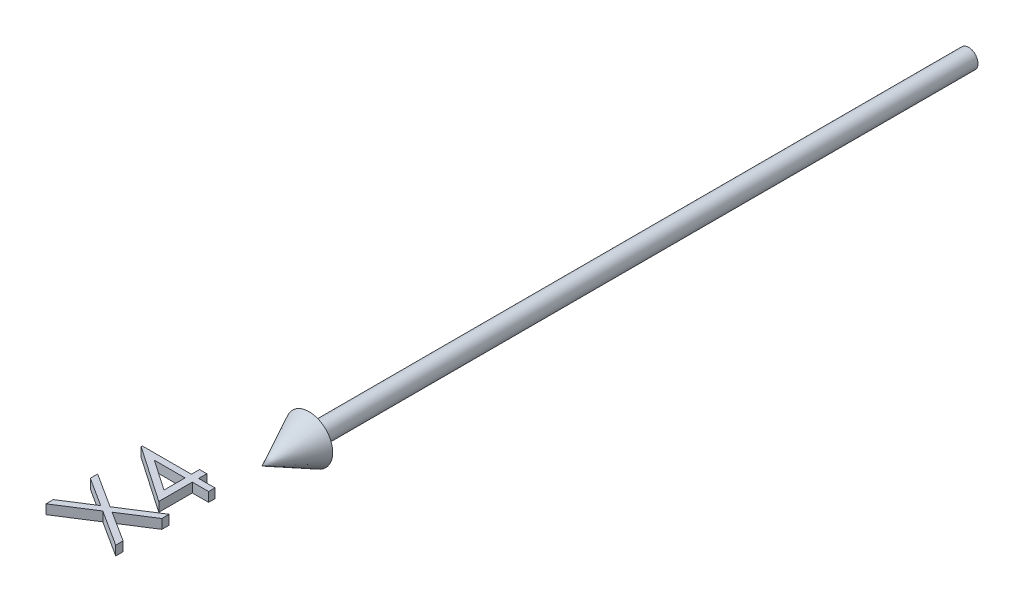
ISO-10303-21;
HEADER;
FILE_DESCRIPTION(('STEP AP214'),'2;1');
FILE_NAME('part.step','',(''),(''),'','','');
FILE_SCHEMA(('AUTOMOTIVE_DESIGN { 1 0 10303 214 1 1 1 1 }'));
ENDSEC;
DATA;
#1=APPLICATION_CONTEXT('core data for automotive mechanical design processes');
#2=APPLICATION_PROTOCOL_DEFINITION('international standard','automotive_design',2000,#1);
#3=PRODUCT_CONTEXT('',#1,'mechanical');
#4=PRODUCT('Part','Part','',(#3));
#5=PRODUCT_RELATED_PRODUCT_CATEGORY('part','',(#4));
#6=PRODUCT_DEFINITION_FORMATION('','',#4);
#7=PRODUCT_DEFINITION_CONTEXT('part definition',#1,'design');
#8=PRODUCT_DEFINITION('design','',#6,#7);
#9=PRODUCT_DEFINITION_SHAPE('','',#8);
#10=(LENGTH_UNIT() NAMED_UNIT(*) SI_UNIT(.MILLI.,.METRE.));
#11=(NAMED_UNIT(*) PLANE_ANGLE_UNIT() SI_UNIT($,.RADIAN.));
#12=(NAMED_UNIT(*) SI_UNIT($,.STERADIAN.) SOLID_ANGLE_UNIT());
#13=UNCERTAINTY_MEASURE_WITH_UNIT(LENGTH_MEASURE(1.E-05),#10,'distance_accuracy_value','');
#14=(GEOMETRIC_REPRESENTATION_CONTEXT(3) GLOBAL_UNCERTAINTY_ASSIGNED_CONTEXT((#13)) GLOBAL_UNIT_ASSIGNED_CONTEXT((#10,
#11,#12)) REPRESENTATION_CONTEXT('',''));
#15=CARTESIAN_POINT('',(0.,0.,0.));
#16=DIRECTION('',(0.,0.,1.));
#17=DIRECTION('',(1.,0.,0.));
#18=AXIS2_PLACEMENT_3D('',#15,#16,#17);
#19=CARTESIAN_POINT('',(-7.65024038461539,1.,176.159855769231));
#20=DIRECTION('',(0.539190475611023,0.,0.842183846324755));
#21=DIRECTION('',(0.842183846324755,0.,-0.539190475611023));
#22=AXIS2_PLACEMENT_3D('',#19,#20,#21);
#23=PLANE('',#22);
#24=DIRECTION('',(0.,-1.,0.));
#25=VECTOR('',#24,1.);
#26=CARTESIAN_POINT('',(-15.,1.,180.865384615385));
#27=LINE('',#26,#25);
#28=CARTESIAN_POINT('',(-15.,1.,180.865384615385));
#29=VERTEX_POINT('',#28);
#30=CARTESIAN_POINT('',(-15.,-1.,180.865384615385));
#31=VERTEX_POINT('',#30);
#32=EDGE_CURVE('E49',#29,#31,#27,.T.);
#33=ORIENTED_EDGE('',*,*,#32,.T.);
#34=DIRECTION('',(-0.842183846324755,0.,0.539190475611023));
#35=VECTOR('',#34,1.);
#36=CARTESIAN_POINT('',(-7.65024038461539,-1.,176.159855769231));
#37=LINE('',#36,#35);
#38=CARTESIAN_POINT('',(-7.65024038461539,-1.,176.159855769231));
#39=VERTEX_POINT('',#38);
#40=EDGE_CURVE('E134',#39,#31,#37,.T.);
#41=ORIENTED_EDGE('',*,*,#40,.F.);
#42=DIRECTION('',(0.,-1.,0.));
#43=VECTOR('',#42,1.);
#44=CARTESIAN_POINT('',(-7.65024038461539,1.,176.159855769231));
#45=LINE('',#44,#43);
#46=CARTESIAN_POINT('',(-7.65024038461539,1.,176.159855769231));
#47=VERTEX_POINT('',#46);
#48=EDGE_CURVE('E12',#47,#39,#45,.T.);
#49=ORIENTED_EDGE('',*,*,#48,.F.);
#50=DIRECTION('',(-0.842183846324755,0.,0.539190475611023));
#51=VECTOR('',#50,1.);
#52=CARTESIAN_POINT('',(-7.65024038461539,1.,176.159855769231));
#53=LINE('',#52,#51);
#54=EDGE_CURVE('E135',#47,#29,#53,.T.);
#55=ORIENTED_EDGE('',*,*,#54,.T.);
#56=EDGE_LOOP('',(#33,#41,#49,#55));
#57=FACE_BOUND('',#56,.T.);
#58=ADVANCED_FACE('F46',(#57),#23,.T.);
#59=CARTESIAN_POINT('',(0.,1.,181.057692307692));
#60=DIRECTION('',(-0.539185104098949,0.,0.842187285298113));
#61=DIRECTION('',(0.842187285298113,0.,0.539185104098949));
#62=AXIS2_PLACEMENT_3D('',#59,#60,#61);
#63=PLANE('',#62);
#64=ORIENTED_EDGE('',*,*,#48,.T.);
#65=DIRECTION('',(-0.842187285298113,0.,-0.539185104098949));
#66=VECTOR('',#65,1.);
#67=CARTESIAN_POINT('',(0.,-1.,181.057692307692));
#68=LINE('',#67,#66);
#69=CARTESIAN_POINT('',(0.,-1.,181.057692307692));
#70=VERTEX_POINT('',#69);
#71=EDGE_CURVE('E152',#70,#39,#68,.T.);
#72=ORIENTED_EDGE('',*,*,#71,.F.);
#73=DIRECTION('',(0.,-1.,0.));
#74=VECTOR('',#73,1.);
#75=CARTESIAN_POINT('',(0.,1.,181.057692307692));
#76=LINE('',#75,#74);
#77=CARTESIAN_POINT('',(0.,1.,181.057692307692));
#78=VERTEX_POINT('',#77);
#79=EDGE_CURVE('E54',#78,#70,#76,.T.);
#80=ORIENTED_EDGE('',*,*,#79,.F.);
#81=DIRECTION('',(-0.842187285298113,0.,-0.539185104098949));
#82=VECTOR('',#81,1.);
#83=CARTESIAN_POINT('',(0.,1.,181.057692307692));
#84=LINE('',#83,#82);
#85=EDGE_CURVE('E140',#78,#47,#84,.T.);
#86=ORIENTED_EDGE('',*,*,#85,.T.);
#87=EDGE_LOOP('',(#64,#72,#80,#86));
#88=FACE_BOUND('',#87,.T.);
#89=ADVANCED_FACE('F264',(#88),#63,.T.);
#90=CARTESIAN_POINT('',(0.,1.,179.504206730769));
#91=DIRECTION('',(1.,0.,0.));
#92=DIRECTION('',(0.,0.,-1.));
#93=AXIS2_PLACEMENT_3D('',#90,#91,#92);
#94=PLANE('',#93);
#95=ORIENTED_EDGE('',*,*,#79,.T.);
#96=DIRECTION('',(0.,0.,1.));
#97=VECTOR('',#96,1.);
#98=CARTESIAN_POINT('',(0.,-1.,179.504206730769));
#99=LINE('',#98,#97);
#100=CARTESIAN_POINT('',(0.,-1.,179.504206730769));
#101=VERTEX_POINT('',#100);
#102=EDGE_CURVE('E177',#101,#70,#99,.T.);
#103=ORIENTED_EDGE('',*,*,#102,.F.);
#104=DIRECTION('',(0.,-1.,0.));
#105=VECTOR('',#104,1.);
#106=CARTESIAN_POINT('',(0.,1.,179.504206730769));
#107=LINE('',#106,#105);
#108=CARTESIAN_POINT('',(0.,1.,179.504206730769));
#109=VERTEX_POINT('',#108);
#110=EDGE_CURVE('E211',#109,#101,#107,.T.);
#111=ORIENTED_EDGE('',*,*,#110,.F.);
#112=DIRECTION('',(0.,0.,1.));
#113=VECTOR('',#112,1.);
#114=CARTESIAN_POINT('',(0.,1.,179.504206730769));
#115=LINE('',#114,#113);
#116=EDGE_CURVE('E207',#109,#78,#115,.T.);
#117=ORIENTED_EDGE('',*,*,#116,.T.);
#118=EDGE_LOOP('',(#95,#103,#111,#117));
#119=FACE_BOUND('',#118,.T.);
#120=ADVANCED_FACE('F262',(#119),#94,.T.);
#121=CARTESIAN_POINT('',(-6.43629807692308,1.,175.384615384615));
#122=DIRECTION('',(0.539087169942496,0.,-0.842249976671648));
#123=DIRECTION('',(-0.842249976671648,0.,-0.539087169942496));
#124=AXIS2_PLACEMENT_3D('',#121,#122,#123);
#125=PLANE('',#124);
#126=ORIENTED_EDGE('',*,*,#110,.T.);
#127=DIRECTION('',(0.842249976671648,0.,0.539087169942496));
#128=VECTOR('',#127,1.);
#129=CARTESIAN_POINT('',(-6.43629807692308,-1.,175.384615384615));
#130=LINE('',#129,#128);
#131=CARTESIAN_POINT('',(-6.43629807692308,-1.,175.384615384615));
#132=VERTEX_POINT('',#131);
#133=EDGE_CURVE('E174',#132,#101,#130,.T.);
#134=ORIENTED_EDGE('',*,*,#133,.F.);
#135=DIRECTION('',(0.,-1.,0.));
#136=VECTOR('',#135,1.);
#137=CARTESIAN_POINT('',(-6.43629807692308,1.,175.384615384615));
#138=LINE('',#137,#136);
#139=CARTESIAN_POINT('',(-6.43629807692308,1.,175.384615384615));
#140=VERTEX_POINT('',#139);
#141=EDGE_CURVE('E213',#140,#132,#138,.T.);
#142=ORIENTED_EDGE('',*,*,#141,.F.);
#143=DIRECTION('',(0.842249976671648,0.,0.539087169942496));
#144=VECTOR('',#143,1.);
#145=CARTESIAN_POINT('',(-6.43629807692308,1.,175.384615384615));
#146=LINE('',#145,#144);
#147=EDGE_CURVE('E204',#140,#109,#146,.T.);
#148=ORIENTED_EDGE('',*,*,#147,.T.);
#149=EDGE_LOOP('',(#126,#134,#142,#148));
#150=FACE_BOUND('',#149,.T.);
#151=ADVANCED_FACE('F260',(#150),#125,.T.);
#152=CARTESIAN_POINT('',(0.,1.,171.265024038462));
#153=DIRECTION('',(0.539087169942498,0.,0.842249976671646));
#154=DIRECTION('',(0.842249976671646,0.,-0.539087169942498));
#155=AXIS2_PLACEMENT_3D('',#152,#153,#154);
#156=PLANE('',#155);
#157=ORIENTED_EDGE('',*,*,#141,.T.);
#158=DIRECTION('',(-0.842249976671646,0.,0.539087169942498));
#159=VECTOR('',#158,1.);
#160=CARTESIAN_POINT('',(0.,-1.,171.265024038462));
#161=LINE('',#160,#159);
#162=CARTESIAN_POINT('',(0.,-1.,171.265024038462));
#163=VERTEX_POINT('',#162);
#164=EDGE_CURVE('E171',#163,#132,#161,.T.);
#165=ORIENTED_EDGE('',*,*,#164,.F.);
#166=DIRECTION('',(0.,-1.,0.));
#167=VECTOR('',#166,1.);
#168=CARTESIAN_POINT('',(0.,1.,171.265024038462));
#169=LINE('',#168,#167);
#170=CARTESIAN_POINT('',(0.,1.,171.265024038462));
#171=VERTEX_POINT('',#170);
#172=EDGE_CURVE('E215',#171,#163,#169,.T.);
#173=ORIENTED_EDGE('',*,*,#172,.F.);
#174=DIRECTION('',(-0.842249976671646,0.,0.539087169942498));
#175=VECTOR('',#174,1.);
#176=CARTESIAN_POINT('',(0.,1.,171.265024038462));
#177=LINE('',#176,#175);
#178=EDGE_CURVE('E201',#171,#140,#177,.T.);
#179=ORIENTED_EDGE('',*,*,#178,.T.);
#180=EDGE_LOOP('',(#157,#165,#173,#179));
#181=FACE_BOUND('',#180,.T.);
#182=ADVANCED_FACE('F255',(#181),#156,.T.);
#183=CARTESIAN_POINT('',(0.,1.,169.711538461538));
#184=DIRECTION('',(1.,0.,0.));
#185=DIRECTION('',(0.,0.,-1.));
#186=AXIS2_PLACEMENT_3D('',#183,#184,#185);
#187=PLANE('',#186);
#188=ORIENTED_EDGE('',*,*,#172,.T.);
#189=DIRECTION('',(0.,0.,1.));
#190=VECTOR('',#189,1.);
#191=CARTESIAN_POINT('',(0.,-1.,169.711538461538));
#192=LINE('',#191,#190);
#193=CARTESIAN_POINT('',(0.,-1.,169.711538461538));
#194=VERTEX_POINT('',#193);
#195=EDGE_CURVE('E168',#194,#163,#192,.T.);
#196=ORIENTED_EDGE('',*,*,#195,.F.);
#197=DIRECTION('',(0.,-1.,0.));
#198=VECTOR('',#197,1.);
#199=CARTESIAN_POINT('',(0.,1.,169.711538461538));
#200=LINE('',#199,#198);
#201=CARTESIAN_POINT('',(0.,1.,169.711538461538));
#202=VERTEX_POINT('',#201);
#203=EDGE_CURVE('E217',#202,#194,#200,.T.);
#204=ORIENTED_EDGE('',*,*,#203,.F.);
#205=DIRECTION('',(0.,0.,1.));
#206=VECTOR('',#205,1.);
#207=CARTESIAN_POINT('',(0.,1.,169.711538461538));
#208=LINE('',#207,#206);
#209=EDGE_CURVE('E198',#202,#171,#208,.T.);
#210=ORIENTED_EDGE('',*,*,#209,.T.);
#211=EDGE_LOOP('',(#188,#196,#204,#210));
#212=FACE_BOUND('',#211,.T.);
#213=ADVANCED_FACE('F250',(#212),#187,.T.);
#214=CARTESIAN_POINT('',(-7.65024038461539,1.,174.606370192308));
#215=DIRECTION('',(-0.538950419912938,0.,-0.842337488703707));
#216=DIRECTION('',(-0.842337488703707,0.,0.538950419912938));
#217=AXIS2_PLACEMENT_3D('',#214,#215,#216);
#218=PLANE('',#217);
#219=ORIENTED_EDGE('',*,*,#203,.T.);
#220=DIRECTION('',(0.842337488703707,0.,-0.538950419912938));
#221=VECTOR('',#220,1.);
#222=CARTESIAN_POINT('',(-7.65024038461539,-1.,174.606370192308));
#223=LINE('',#222,#221);
#224=CARTESIAN_POINT('',(-7.65024038461539,-1.,174.606370192308));
#225=VERTEX_POINT('',#224);
#226=EDGE_CURVE('E165',#225,#194,#223,.T.);
#227=ORIENTED_EDGE('',*,*,#226,.F.);
#228=DIRECTION('',(0.,-1.,0.));
#229=VECTOR('',#228,1.);
#230=CARTESIAN_POINT('',(-7.65024038461539,1.,174.606370192308));
#231=LINE('',#230,#229);
#232=CARTESIAN_POINT('',(-7.65024038461539,1.,174.606370192308));
#233=VERTEX_POINT('',#232);
#234=EDGE_CURVE('E219',#233,#225,#231,.T.);
#235=ORIENTED_EDGE('',*,*,#234,.F.);
#236=DIRECTION('',(0.842337488703707,0.,-0.538950419912938));
#237=VECTOR('',#236,1.);
#238=CARTESIAN_POINT('',(-7.65024038461539,1.,174.606370192308));
#239=LINE('',#238,#237);
#240=EDGE_CURVE('E195',#233,#202,#239,.T.);
#241=ORIENTED_EDGE('',*,*,#240,.T.);
#242=EDGE_LOOP('',(#219,#227,#235,#241));
#243=FACE_BOUND('',#242,.T.);
#244=ADVANCED_FACE('F248',(#243),#218,.T.);
#245=CARTESIAN_POINT('',(-15.,1.,169.903846153846));
#246=DIRECTION('',(0.538946197134425,0.,-0.842340190537257));
#247=DIRECTION('',(-0.842340190537257,0.,-0.538946197134425));
#248=AXIS2_PLACEMENT_3D('',#245,#246,#247);
#249=PLANE('',#248);
#250=ORIENTED_EDGE('',*,*,#234,.T.);
#251=DIRECTION('',(0.842340190537257,0.,0.538946197134425));
#252=VECTOR('',#251,1.);
#253=CARTESIAN_POINT('',(-15.,-1.,169.903846153846));
#254=LINE('',#253,#252);
#255=CARTESIAN_POINT('',(-15.,-1.,169.903846153846));
#256=VERTEX_POINT('',#255);
#257=EDGE_CURVE('E162',#256,#225,#254,.T.);
#258=ORIENTED_EDGE('',*,*,#257,.F.);
#259=DIRECTION('',(0.,-1.,0.));
#260=VECTOR('',#259,1.);
#261=CARTESIAN_POINT('',(-15.,1.,169.903846153846));
#262=LINE('',#261,#260);
#263=CARTESIAN_POINT('',(-15.,1.,169.903846153846));
#264=VERTEX_POINT('',#263);
#265=EDGE_CURVE('E221',#264,#256,#262,.T.);
#266=ORIENTED_EDGE('',*,*,#265,.F.);
#267=DIRECTION('',(0.842340190537257,0.,0.538946197134425));
#268=VECTOR('',#267,1.);
#269=CARTESIAN_POINT('',(-15.,1.,169.903846153846));
#270=LINE('',#269,#268);
#271=EDGE_CURVE('E192',#264,#233,#270,.T.);
#272=ORIENTED_EDGE('',*,*,#271,.T.);
#273=EDGE_LOOP('',(#250,#258,#266,#272));
#274=FACE_BOUND('',#273,.T.);
#275=ADVANCED_FACE('F243',(#274),#249,.T.);
#276=CARTESIAN_POINT('',(-15.,1.,171.457331730769));
#277=DIRECTION('',(-1.,0.,0.));
#278=DIRECTION('',(0.,0.,1.));
#279=AXIS2_PLACEMENT_3D('',#276,#277,#278);
#280=PLANE('',#279);
#281=ORIENTED_EDGE('',*,*,#265,.T.);
#282=DIRECTION('',(0.,0.,-1.));
#283=VECTOR('',#282,1.);
#284=CARTESIAN_POINT('',(-15.,-1.,171.457331730769));
#285=LINE('',#284,#283);
#286=CARTESIAN_POINT('',(-15.,-1.,171.457331730769));
#287=VERTEX_POINT('',#286);
#288=EDGE_CURVE('E159',#287,#256,#285,.T.);
#289=ORIENTED_EDGE('',*,*,#288,.F.);
#290=DIRECTION('',(0.,-1.,0.));
#291=VECTOR('',#290,1.);
#292=CARTESIAN_POINT('',(-15.,1.,171.457331730769));
#293=LINE('',#292,#291);
#294=CARTESIAN_POINT('',(-15.,1.,171.457331730769));
#295=VERTEX_POINT('',#294);
#296=EDGE_CURVE('E223',#295,#287,#293,.T.);
#297=ORIENTED_EDGE('',*,*,#296,.F.);
#298=DIRECTION('',(0.,0.,-1.));
#299=VECTOR('',#298,1.);
#300=CARTESIAN_POINT('',(-15.,1.,171.457331730769));
#301=LINE('',#300,#299);
#302=EDGE_CURVE('E189',#295,#264,#301,.T.);
#303=ORIENTED_EDGE('',*,*,#302,.T.);
#304=EDGE_LOOP('',(#281,#289,#297,#303));
#305=FACE_BOUND('',#304,.T.);
#306=ADVANCED_FACE('F236',(#305),#280,.T.);
#307=CARTESIAN_POINT('',(-8.86418269230769,1.,175.384615384615));
#308=DIRECTION('',(-0.539088809128563,0.,0.842248927498485));
#309=DIRECTION('',(0.842248927498485,0.,0.539088809128563));
#310=AXIS2_PLACEMENT_3D('',#307,#308,#309);
#311=PLANE('',#310);
#312=ORIENTED_EDGE('',*,*,#296,.T.);
#313=DIRECTION('',(-0.842248927498485,0.,-0.539088809128563));
#314=VECTOR('',#313,1.);
#315=CARTESIAN_POINT('',(-8.86418269230769,-1.,175.384615384615));
#316=LINE('',#315,#314);
#317=CARTESIAN_POINT('',(-8.86418269230769,-1.,175.384615384615));
#318=VERTEX_POINT('',#317);
#319=EDGE_CURVE('E156',#318,#287,#316,.T.);
#320=ORIENTED_EDGE('',*,*,#319,.F.);
#321=DIRECTION('',(0.,-1.,0.));
#322=VECTOR('',#321,1.);
#323=CARTESIAN_POINT('',(-8.86418269230769,1.,175.384615384615));
#324=LINE('',#323,#322);
#325=CARTESIAN_POINT('',(-8.86418269230769,1.,175.384615384615));
#326=VERTEX_POINT('',#325);
#327=EDGE_CURVE('E225',#326,#318,#324,.T.);
#328=ORIENTED_EDGE('',*,*,#327,.F.);
#329=DIRECTION('',(-0.842248927498485,0.,-0.539088809128563));
#330=VECTOR('',#329,1.);
#331=CARTESIAN_POINT('',(-8.86418269230769,1.,175.384615384615));
#332=LINE('',#331,#330);
#333=EDGE_CURVE('E186',#326,#295,#332,.T.);
#334=ORIENTED_EDGE('',*,*,#333,.T.);
#335=EDGE_LOOP('',(#312,#320,#328,#334));
#336=FACE_BOUND('',#335,.T.);
#337=ADVANCED_FACE('F233',(#336),#311,.T.);
#338=CARTESIAN_POINT('',(-15.,1.,179.311899038462));
#339=DIRECTION('',(-0.53908880912856,0.,-0.842248927498487));
#340=DIRECTION('',(-0.842248927498487,0.,0.53908880912856));
#341=AXIS2_PLACEMENT_3D('',#338,#339,#340);
#342=PLANE('',#341);
#343=ORIENTED_EDGE('',*,*,#327,.T.);
#344=DIRECTION('',(0.842248927498486,0.,-0.53908880912856));
#345=VECTOR('',#344,1.);
#346=CARTESIAN_POINT('',(-15.,-1.,179.311899038462));
#347=LINE('',#346,#345);
#348=CARTESIAN_POINT('',(-15.,-1.,179.311899038462));
#349=VERTEX_POINT('',#348);
#350=EDGE_CURVE('E147',#349,#318,#347,.T.);
#351=ORIENTED_EDGE('',*,*,#350,.F.);
#352=DIRECTION('',(0.,-1.,0.));
#353=VECTOR('',#352,1.);
#354=CARTESIAN_POINT('',(-15.,1.,179.311899038462));
#355=LINE('',#354,#353);
#356=CARTESIAN_POINT('',(-15.,1.,179.311899038462));
#357=VERTEX_POINT('',#356);
#358=EDGE_CURVE('E139',#357,#349,#355,.T.);
#359=ORIENTED_EDGE('',*,*,#358,.F.);
#360=DIRECTION('',(0.842248927498486,0.,-0.53908880912856));
#361=VECTOR('',#360,1.);
#362=CARTESIAN_POINT('',(-15.,1.,179.311899038462));
#363=LINE('',#362,#361);
#364=EDGE_CURVE('E183',#357,#326,#363,.T.);
#365=ORIENTED_EDGE('',*,*,#364,.T.);
#366=EDGE_LOOP('',(#343,#351,#359,#365));
#367=FACE_BOUND('',#366,.T.);
#368=ADVANCED_FACE('F227',(#367),#342,.T.);
#369=CARTESIAN_POINT('',(-15.,1.,180.865384615385));
#370=DIRECTION('',(-1.,0.,0.));
#371=DIRECTION('',(0.,0.,1.));
#372=AXIS2_PLACEMENT_3D('',#369,#370,#371);
#373=PLANE('',#372);
#374=ORIENTED_EDGE('',*,*,#358,.T.);
#375=DIRECTION('',(0.,0.,-1.));
#376=VECTOR('',#375,1.);
#377=CARTESIAN_POINT('',(-15.,-1.,180.865384615385));
#378=LINE('',#377,#376);
#379=EDGE_CURVE('E142',#31,#349,#378,.T.);
#380=ORIENTED_EDGE('',*,*,#379,.F.);
#381=ORIENTED_EDGE('',*,*,#32,.F.);
#382=DIRECTION('',(0.,0.,-1.));
#383=VECTOR('',#382,1.);
#384=CARTESIAN_POINT('',(-15.,1.,180.865384615385));
#385=LINE('',#384,#383);
#386=EDGE_CURVE('E181',#29,#357,#385,.T.);
#387=ORIENTED_EDGE('',*,*,#386,.T.);
#388=EDGE_LOOP('',(#374,#380,#381,#387));
#389=FACE_BOUND('',#388,.T.);
#390=ADVANCED_FACE('F143',(#389),#373,.T.);
#391=CARTESIAN_POINT('',(0.,1.,0.));
#392=DIRECTION('',(0.,-1.,0.));
#393=DIRECTION('',(0.,0.,-1.));
#394=AXIS2_PLACEMENT_3D('',#391,#392,#393);
#395=PLANE('',#394);
#396=ORIENTED_EDGE('',*,*,#54,.F.);
#397=ORIENTED_EDGE('',*,*,#85,.F.);
#398=ORIENTED_EDGE('',*,*,#116,.F.);
#399=ORIENTED_EDGE('',*,*,#147,.F.);
#400=ORIENTED_EDGE('',*,*,#178,.F.);
#401=ORIENTED_EDGE('',*,*,#209,.F.);
#402=ORIENTED_EDGE('',*,*,#240,.F.);
#403=ORIENTED_EDGE('',*,*,#271,.F.);
#404=ORIENTED_EDGE('',*,*,#302,.F.);
#405=ORIENTED_EDGE('',*,*,#333,.F.);
#406=ORIENTED_EDGE('',*,*,#364,.F.);
#407=ORIENTED_EDGE('',*,*,#386,.F.);
#408=EDGE_LOOP('',(#396,#397,#398,#399,#400,#401,#402,#403,#404,#405,#406,#407));
#409=FACE_BOUND('',#408,.T.);
#410=ADVANCED_FACE('F239',(#409),#395,.F.);
#411=CARTESIAN_POINT('',(0.,-1.,0.));
#412=DIRECTION('',(0.,-1.,0.));
#413=DIRECTION('',(0.,0.,-1.));
#414=AXIS2_PLACEMENT_3D('',#411,#412,#413);
#415=PLANE('',#414);
#416=ORIENTED_EDGE('',*,*,#40,.T.);
#417=ORIENTED_EDGE('',*,*,#379,.T.);
#418=ORIENTED_EDGE('',*,*,#350,.T.);
#419=ORIENTED_EDGE('',*,*,#319,.T.);
#420=ORIENTED_EDGE('',*,*,#288,.T.);
#421=ORIENTED_EDGE('',*,*,#257,.T.);
#422=ORIENTED_EDGE('',*,*,#226,.T.);
#423=ORIENTED_EDGE('',*,*,#195,.T.);
#424=ORIENTED_EDGE('',*,*,#164,.T.);
#425=ORIENTED_EDGE('',*,*,#133,.T.);
#426=ORIENTED_EDGE('',*,*,#102,.T.);
#427=ORIENTED_EDGE('',*,*,#71,.T.);
#428=EDGE_LOOP('',(#416,#417,#418,#419,#420,#421,#422,#423,#424,#425,#426,#427));
#429=FACE_BOUND('',#428,.T.);
#430=ADVANCED_FACE('F150',(#429),#415,.T.);
#431=CLOSED_SHELL('',(#58,#89,#120,#151,#182,#213,#244,#275,#306,#337,#368,#390,#410,#430));
#432=MANIFOLD_SOLID_BREP('B2',#431);
#433=CARTESIAN_POINT('',(0.,1.,0.));
#434=DIRECTION('',(0.,-1.,0.));
#435=DIRECTION('',(0.,0.,-1.));
#436=AXIS2_PLACEMENT_3D('',#433,#434,#435);
#437=PLANE('',#436);
#438=DIRECTION('',(-0.824332768950697,0.,-0.566105543193208));
#439=VECTOR('',#438,1.);
#440=CARTESIAN_POINT('',(-3.46153846153846,1.,168.461538461538));
#441=LINE('',#440,#439);
#442=CARTESIAN_POINT('',(-3.46153846153846,1.,168.461538461538));
#443=VERTEX_POINT('',#442);
#444=CARTESIAN_POINT('',(-15.3846153846154,1.,160.2734375));
#445=VERTEX_POINT('',#444);
#446=EDGE_CURVE('E518',#443,#445,#441,.T.);
#447=ORIENTED_EDGE('',*,*,#446,.F.);
#448=DIRECTION('',(0.,0.,1.));
#449=VECTOR('',#448,1.);
#450=CARTESIAN_POINT('',(-3.46153846153846,1.,161.346153846154));
#451=LINE('',#450,#449);
#452=CARTESIAN_POINT('',(-3.46153846153846,1.,161.346153846154));
#453=VERTEX_POINT('',#452);
#454=EDGE_CURVE('E594',#453,#443,#451,.T.);
#455=ORIENTED_EDGE('',*,*,#454,.F.);
#456=DIRECTION('',(-1.,0.,0.));
#457=VECTOR('',#456,1.);
#458=CARTESIAN_POINT('',(0.,1.,161.346153846154));
#459=LINE('',#458,#457);
#460=CARTESIAN_POINT('',(0.,1.,161.346153846154));
#461=VERTEX_POINT('',#460);
#462=EDGE_CURVE('E591',#461,#453,#459,.T.);
#463=ORIENTED_EDGE('',*,*,#462,.F.);
#464=DIRECTION('',(0.,0.,1.));
#465=VECTOR('',#464,1.);
#466=CARTESIAN_POINT('',(0.,1.,160.));
#467=LINE('',#466,#465);
#468=CARTESIAN_POINT('',(0.,1.,160.));
#469=VERTEX_POINT('',#468);
#470=EDGE_CURVE('E588',#469,#461,#467,.T.);
#471=ORIENTED_EDGE('',*,*,#470,.F.);
#472=DIRECTION('',(1.,0.,0.));
#473=VECTOR('',#472,1.);
#474=CARTESIAN_POINT('',(-3.46153846153846,1.,160.));
#475=LINE('',#474,#473);
#476=CARTESIAN_POINT('',(-3.46153846153846,1.,160.));
#477=VERTEX_POINT('',#476);
#478=EDGE_CURVE('E585',#477,#469,#475,.T.);
#479=ORIENTED_EDGE('',*,*,#478,.F.);
#480=DIRECTION('',(0.,0.,1.));
#481=VECTOR('',#480,1.);
#482=CARTESIAN_POINT('',(-3.46153846153846,1.,158.269230769231));
#483=LINE('',#482,#481);
#484=CARTESIAN_POINT('',(-3.46153846153846,1.,158.269230769231));
#485=VERTEX_POINT('',#484);
#486=EDGE_CURVE('E582',#485,#477,#483,.T.);
#487=ORIENTED_EDGE('',*,*,#486,.F.);
#488=DIRECTION('',(1.,0.,0.));
#489=VECTOR('',#488,1.);
#490=CARTESIAN_POINT('',(-5.,1.,158.269230769231));
#491=LINE('',#490,#489);
#492=CARTESIAN_POINT('',(-5.,1.,158.269230769231));
#493=VERTEX_POINT('',#492);
#494=EDGE_CURVE('E579',#493,#485,#491,.T.);
#495=ORIENTED_EDGE('',*,*,#494,.F.);
#496=DIRECTION('',(0.,0.,-1.));
#497=VECTOR('',#496,1.);
#498=CARTESIAN_POINT('',(-5.,1.,160.));
#499=LINE('',#498,#497);
#500=CARTESIAN_POINT('',(-5.,1.,160.));
#501=VERTEX_POINT('',#500);
#502=EDGE_CURVE('E576',#501,#493,#499,.T.);
#503=ORIENTED_EDGE('',*,*,#502,.F.);
#504=DIRECTION('',(1.,0.,0.));
#505=VECTOR('',#504,1.);
#506=CARTESIAN_POINT('',(-15.3846153846154,1.,160.));
#507=LINE('',#506,#505);
#508=CARTESIAN_POINT('',(-15.3846153846154,1.,160.));
#509=VERTEX_POINT('',#508);
#510=EDGE_CURVE('E573',#509,#501,#507,.T.);
#511=ORIENTED_EDGE('',*,*,#510,.F.);
#512=DIRECTION('',(0.,0.,-1.));
#513=VECTOR('',#512,1.);
#514=CARTESIAN_POINT('',(-15.3846153846154,1.,160.2734375));
#515=LINE('',#514,#513);
#516=EDGE_CURVE('E570',#445,#509,#515,.T.);
#517=ORIENTED_EDGE('',*,*,#516,.F.);
#518=EDGE_LOOP('',(#447,#455,#463,#471,#479,#487,#495,#503,#511,#517));
#519=FACE_BOUND('',#518,.T.);
#520=DIRECTION('',(0.,0.,-1.));
#521=VECTOR('',#520,1.);
#522=CARTESIAN_POINT('',(-5.,1.,165.817307692308));
#523=LINE('',#522,#521);
#524=CARTESIAN_POINT('',(-5.,1.,165.817307692308));
#525=VERTEX_POINT('',#524);
#526=CARTESIAN_POINT('',(-5.,1.,161.346153846154));
#527=VERTEX_POINT('',#526);
#528=EDGE_CURVE('E515',#525,#527,#523,.T.);
#529=ORIENTED_EDGE('',*,*,#528,.F.);
#530=DIRECTION('',(0.82448552013318,0.,0.565883050718714));
#531=VECTOR('',#530,1.);
#532=CARTESIAN_POINT('',(-11.5144230769231,1.,161.346153846154));
#533=LINE('',#532,#531);
#534=CARTESIAN_POINT('',(-11.5144230769231,1.,161.346153846154));
#535=VERTEX_POINT('',#534);
#536=EDGE_CURVE('E564',#535,#525,#533,.T.);
#537=ORIENTED_EDGE('',*,*,#536,.F.);
#538=DIRECTION('',(-1.,0.,0.));
#539=VECTOR('',#538,1.);
#540=CARTESIAN_POINT('',(-5.,1.,161.346153846154));
#541=LINE('',#540,#539);
#542=EDGE_CURVE('E562',#527,#535,#541,.T.);
#543=ORIENTED_EDGE('',*,*,#542,.F.);
#544=EDGE_LOOP('',(#529,#537,#543));
#545=FACE_BOUND('',#544,.T.);
#546=ADVANCED_FACE('F411',(#519,#545),#437,.F.);
#547=CARTESIAN_POINT('',(-3.46153846153846,1.,168.461538461538));
#548=DIRECTION('',(-0.566105543193208,0.,0.824332768950697));
#549=DIRECTION('',(0.824332768950697,0.,0.566105543193208));
#550=AXIS2_PLACEMENT_3D('',#547,#548,#549);
#551=PLANE('',#550);
#552=DIRECTION('',(0.,-1.,0.));
#553=VECTOR('',#552,1.);
#554=CARTESIAN_POINT('',(-15.3846153846154,1.,160.2734375));
#555=LINE('',#554,#553);
#556=CARTESIAN_POINT('',(-15.3846153846154,-1.,160.2734375));
#557=VERTEX_POINT('',#556);
#558=EDGE_CURVE('E415',#445,#557,#555,.T.);
#559=ORIENTED_EDGE('',*,*,#558,.T.);
#560=DIRECTION('',(-0.824332768950697,0.,-0.566105543193208));
#561=VECTOR('',#560,1.);
#562=CARTESIAN_POINT('',(-3.46153846153846,-1.,168.461538461538));
#563=LINE('',#562,#561);
#564=CARTESIAN_POINT('',(-3.46153846153846,-1.,168.461538461538));
#565=VERTEX_POINT('',#564);
#566=EDGE_CURVE('E531',#565,#557,#563,.T.);
#567=ORIENTED_EDGE('',*,*,#566,.F.);
#568=DIRECTION('',(0.,-1.,0.));
#569=VECTOR('',#568,1.);
#570=CARTESIAN_POINT('',(-3.46153846153846,1.,168.461538461538));
#571=LINE('',#570,#569);
#572=EDGE_CURVE('E44',#443,#565,#571,.T.);
#573=ORIENTED_EDGE('',*,*,#572,.F.);
#574=ORIENTED_EDGE('',*,*,#446,.T.);
#575=EDGE_LOOP('',(#559,#567,#573,#574));
#576=FACE_BOUND('',#575,.T.);
#577=ADVANCED_FACE('F413',(#576),#551,.T.);
#578=CARTESIAN_POINT('',(-3.46153846153846,1.,161.346153846154));
#579=DIRECTION('',(1.,0.,0.));
#580=DIRECTION('',(0.,0.,-1.));
#581=AXIS2_PLACEMENT_3D('',#578,#579,#580);
#582=PLANE('',#581);
#583=ORIENTED_EDGE('',*,*,#572,.T.);
#584=DIRECTION('',(0.,0.,1.));
#585=VECTOR('',#584,1.);
#586=CARTESIAN_POINT('',(-3.46153846153846,-1.,161.346153846154));
#587=LINE('',#586,#585);
#588=CARTESIAN_POINT('',(-3.46153846153846,-1.,161.346153846154));
#589=VERTEX_POINT('',#588);
#590=EDGE_CURVE('E558',#589,#565,#587,.T.);
#591=ORIENTED_EDGE('',*,*,#590,.F.);
#592=DIRECTION('',(0.,-1.,0.));
#593=VECTOR('',#592,1.);
#594=CARTESIAN_POINT('',(-3.46153846153846,1.,161.346153846154));
#595=LINE('',#594,#593);
#596=EDGE_CURVE('E420',#453,#589,#595,.T.);
#597=ORIENTED_EDGE('',*,*,#596,.F.);
#598=ORIENTED_EDGE('',*,*,#454,.T.);
#599=EDGE_LOOP('',(#583,#591,#597,#598));
#600=FACE_BOUND('',#599,.T.);
#601=ADVANCED_FACE('F618',(#600),#582,.T.);
#602=CARTESIAN_POINT('',(0.,1.,161.346153846154));
#603=DIRECTION('',(0.,0.,1.));
#604=DIRECTION('',(1.,0.,0.));
#605=AXIS2_PLACEMENT_3D('',#602,#603,#604);
#606=PLANE('',#605);
#607=ORIENTED_EDGE('',*,*,#596,.T.);
#608=DIRECTION('',(-1.,0.,0.));
#609=VECTOR('',#608,1.);
#610=CARTESIAN_POINT('',(0.,-1.,161.346153846154));
#611=LINE('',#610,#609);
#612=CARTESIAN_POINT('',(0.,-1.,161.346153846154));
#613=VERTEX_POINT('',#612);
#614=EDGE_CURVE('E555',#613,#589,#611,.T.);
#615=ORIENTED_EDGE('',*,*,#614,.F.);
#616=DIRECTION('',(0.,-1.,0.));
#617=VECTOR('',#616,1.);
#618=CARTESIAN_POINT('',(0.,1.,161.346153846154));
#619=LINE('',#618,#617);
#620=EDGE_CURVE('E598',#461,#613,#619,.T.);
#621=ORIENTED_EDGE('',*,*,#620,.F.);
#622=ORIENTED_EDGE('',*,*,#462,.T.);
#623=EDGE_LOOP('',(#607,#615,#621,#622));
#624=FACE_BOUND('',#623,.T.);
#625=ADVANCED_FACE('F647',(#624),#606,.T.);
#626=CARTESIAN_POINT('',(0.,1.,160.));
#627=DIRECTION('',(1.,0.,0.));
#628=DIRECTION('',(0.,0.,-1.));
#629=AXIS2_PLACEMENT_3D('',#626,#627,#628);
#630=PLANE('',#629);
#631=ORIENTED_EDGE('',*,*,#620,.T.);
#632=DIRECTION('',(0.,0.,1.));
#633=VECTOR('',#632,1.);
#634=CARTESIAN_POINT('',(0.,-1.,160.));
#635=LINE('',#634,#633);
#636=CARTESIAN_POINT('',(0.,-1.,160.));
#637=VERTEX_POINT('',#636);
#638=EDGE_CURVE('E552',#637,#613,#635,.T.);
#639=ORIENTED_EDGE('',*,*,#638,.F.);
#640=DIRECTION('',(0.,-1.,0.));
#641=VECTOR('',#640,1.);
#642=CARTESIAN_POINT('',(0.,1.,160.));
#643=LINE('',#642,#641);
#644=EDGE_CURVE('E600',#469,#637,#643,.T.);
#645=ORIENTED_EDGE('',*,*,#644,.F.);
#646=ORIENTED_EDGE('',*,*,#470,.T.);
#647=EDGE_LOOP('',(#631,#639,#645,#646));
#648=FACE_BOUND('',#647,.T.);
#649=ADVANCED_FACE('F645',(#648),#630,.T.);
#650=CARTESIAN_POINT('',(-3.46153846153846,1.,160.));
#651=DIRECTION('',(0.,0.,-1.));
#652=DIRECTION('',(-1.,0.,0.));
#653=AXIS2_PLACEMENT_3D('',#650,#651,#652);
#654=PLANE('',#653);
#655=ORIENTED_EDGE('',*,*,#644,.T.);
#656=DIRECTION('',(1.,0.,0.));
#657=VECTOR('',#656,1.);
#658=CARTESIAN_POINT('',(-3.46153846153846,-1.,160.));
#659=LINE('',#658,#657);
#660=CARTESIAN_POINT('',(-3.46153846153846,-1.,160.));
#661=VERTEX_POINT('',#660);
#662=EDGE_CURVE('E549',#661,#637,#659,.T.);
#663=ORIENTED_EDGE('',*,*,#662,.F.);
#664=DIRECTION('',(0.,-1.,0.));
#665=VECTOR('',#664,1.);
#666=CARTESIAN_POINT('',(-3.46153846153846,1.,160.));
#667=LINE('',#666,#665);
#668=EDGE_CURVE('E602',#477,#661,#667,.T.);
#669=ORIENTED_EDGE('',*,*,#668,.F.);
#670=ORIENTED_EDGE('',*,*,#478,.T.);
#671=EDGE_LOOP('',(#655,#663,#669,#670));
#672=FACE_BOUND('',#671,.T.);
#673=ADVANCED_FACE('F643',(#672),#654,.T.);
#674=CARTESIAN_POINT('',(-3.46153846153846,1.,158.269230769231));
#675=DIRECTION('',(1.,0.,0.));
#676=DIRECTION('',(0.,0.,-1.));
#677=AXIS2_PLACEMENT_3D('',#674,#675,#676);
#678=PLANE('',#677);
#679=ORIENTED_EDGE('',*,*,#668,.T.);
#680=DIRECTION('',(0.,0.,1.));
#681=VECTOR('',#680,1.);
#682=CARTESIAN_POINT('',(-3.46153846153846,-1.,158.269230769231));
#683=LINE('',#682,#681);
#684=CARTESIAN_POINT('',(-3.46153846153846,-1.,158.269230769231));
#685=VERTEX_POINT('',#684);
#686=EDGE_CURVE('E546',#685,#661,#683,.T.);
#687=ORIENTED_EDGE('',*,*,#686,.F.);
#688=DIRECTION('',(0.,-1.,0.));
#689=VECTOR('',#688,1.);
#690=CARTESIAN_POINT('',(-3.46153846153846,1.,158.269230769231));
#691=LINE('',#690,#689);
#692=EDGE_CURVE('E604',#485,#685,#691,.T.);
#693=ORIENTED_EDGE('',*,*,#692,.F.);
#694=ORIENTED_EDGE('',*,*,#486,.T.);
#695=EDGE_LOOP('',(#679,#687,#693,#694));
#696=FACE_BOUND('',#695,.T.);
#697=ADVANCED_FACE('F638',(#696),#678,.T.);
#698=CARTESIAN_POINT('',(-5.,1.,158.269230769231));
#699=DIRECTION('',(0.,0.,-1.));
#700=DIRECTION('',(-1.,0.,0.));
#701=AXIS2_PLACEMENT_3D('',#698,#699,#700);
#702=PLANE('',#701);
#703=ORIENTED_EDGE('',*,*,#692,.T.);
#704=DIRECTION('',(1.,0.,0.));
#705=VECTOR('',#704,1.);
#706=CARTESIAN_POINT('',(-5.,-1.,158.269230769231));
#707=LINE('',#706,#705);
#708=CARTESIAN_POINT('',(-5.,-1.,158.269230769231));
#709=VERTEX_POINT('',#708);
#710=EDGE_CURVE('E543',#709,#685,#707,.T.);
#711=ORIENTED_EDGE('',*,*,#710,.F.);
#712=DIRECTION('',(0.,-1.,0.));
#713=VECTOR('',#712,1.);
#714=CARTESIAN_POINT('',(-5.,1.,158.269230769231));
#715=LINE('',#714,#713);
#716=EDGE_CURVE('E606',#493,#709,#715,.T.);
#717=ORIENTED_EDGE('',*,*,#716,.F.);
#718=ORIENTED_EDGE('',*,*,#494,.T.);
#719=EDGE_LOOP('',(#703,#711,#717,#718));
#720=FACE_BOUND('',#719,.T.);
#721=ADVANCED_FACE('F634',(#720),#702,.T.);
#722=CARTESIAN_POINT('',(-5.,1.,160.));
#723=DIRECTION('',(-1.,0.,0.));
#724=DIRECTION('',(0.,0.,1.));
#725=AXIS2_PLACEMENT_3D('',#722,#723,#724);
#726=PLANE('',#725);
#727=ORIENTED_EDGE('',*,*,#716,.T.);
#728=DIRECTION('',(0.,0.,-1.));
#729=VECTOR('',#728,1.);
#730=CARTESIAN_POINT('',(-5.,-1.,160.));
#731=LINE('',#730,#729);
#732=CARTESIAN_POINT('',(-5.,-1.,160.));
#733=VERTEX_POINT('',#732);
#734=EDGE_CURVE('E540',#733,#709,#731,.T.);
#735=ORIENTED_EDGE('',*,*,#734,.F.);
#736=DIRECTION('',(0.,-1.,0.));
#737=VECTOR('',#736,1.);
#738=CARTESIAN_POINT('',(-5.,1.,160.));
#739=LINE('',#738,#737);
#740=EDGE_CURVE('E608',#501,#733,#739,.T.);
#741=ORIENTED_EDGE('',*,*,#740,.F.);
#742=ORIENTED_EDGE('',*,*,#502,.T.);
#743=EDGE_LOOP('',(#727,#735,#741,#742));
#744=FACE_BOUND('',#743,.T.);
#745=ADVANCED_FACE('F632',(#744),#726,.T.);
#746=CARTESIAN_POINT('',(-15.3846153846154,1.,160.));
#747=DIRECTION('',(0.,0.,-1.));
#748=DIRECTION('',(-1.,0.,0.));
#749=AXIS2_PLACEMENT_3D('',#746,#747,#748);
#750=PLANE('',#749);
#751=ORIENTED_EDGE('',*,*,#740,.T.);
#752=DIRECTION('',(1.,0.,0.));
#753=VECTOR('',#752,1.);
#754=CARTESIAN_POINT('',(-15.3846153846154,-1.,160.));
#755=LINE('',#754,#753);
#756=CARTESIAN_POINT('',(-15.3846153846154,-1.,160.));
#757=VERTEX_POINT('',#756);
#758=EDGE_CURVE('E537',#757,#733,#755,.T.);
#759=ORIENTED_EDGE('',*,*,#758,.F.);
#760=DIRECTION('',(0.,-1.,0.));
#761=VECTOR('',#760,1.);
#762=CARTESIAN_POINT('',(-15.3846153846154,1.,160.));
#763=LINE('',#762,#761);
#764=EDGE_CURVE('E609',#509,#757,#763,.T.);
#765=ORIENTED_EDGE('',*,*,#764,.F.);
#766=ORIENTED_EDGE('',*,*,#510,.T.);
#767=EDGE_LOOP('',(#751,#759,#765,#766));
#768=FACE_BOUND('',#767,.T.);
#769=ADVANCED_FACE('F628',(#768),#750,.T.);
#770=CARTESIAN_POINT('',(-15.3846153846154,1.,160.2734375));
#771=DIRECTION('',(-1.,0.,0.));
#772=DIRECTION('',(0.,0.,1.));
#773=AXIS2_PLACEMENT_3D('',#770,#771,#772);
#774=PLANE('',#773);
#775=ORIENTED_EDGE('',*,*,#764,.T.);
#776=DIRECTION('',(0.,0.,-1.));
#777=VECTOR('',#776,1.);
#778=CARTESIAN_POINT('',(-15.3846153846154,-1.,160.2734375));
#779=LINE('',#778,#777);
#780=EDGE_CURVE('E534',#557,#757,#779,.T.);
#781=ORIENTED_EDGE('',*,*,#780,.F.);
#782=ORIENTED_EDGE('',*,*,#558,.F.);
#783=ORIENTED_EDGE('',*,*,#516,.T.);
#784=EDGE_LOOP('',(#775,#781,#782,#783));
#785=FACE_BOUND('',#784,.T.);
#786=ADVANCED_FACE('F613',(#785),#774,.T.);
#787=CARTESIAN_POINT('',(-5.,1.,165.817307692308));
#788=DIRECTION('',(-1.,0.,0.));
#789=DIRECTION('',(0.,0.,1.));
#790=AXIS2_PLACEMENT_3D('',#787,#788,#789);
#791=PLANE('',#790);
#792=DIRECTION('',(0.,-1.,0.));
#793=VECTOR('',#792,1.);
#794=CARTESIAN_POINT('',(-5.,1.,161.346153846154));
#795=LINE('',#794,#793);
#796=CARTESIAN_POINT('',(-5.,-1.,161.346153846154));
#797=VERTEX_POINT('',#796);
#798=EDGE_CURVE('E507',#527,#797,#795,.T.);
#799=ORIENTED_EDGE('',*,*,#798,.T.);
#800=DIRECTION('',(0.,0.,-1.));
#801=VECTOR('',#800,1.);
#802=CARTESIAN_POINT('',(-5.,-1.,165.817307692308));
#803=LINE('',#802,#801);
#804=CARTESIAN_POINT('',(-5.,-1.,165.817307692308));
#805=VERTEX_POINT('',#804);
#806=EDGE_CURVE('E512',#805,#797,#803,.T.);
#807=ORIENTED_EDGE('',*,*,#806,.F.);
#808=DIRECTION('',(0.,-1.,0.));
#809=VECTOR('',#808,1.);
#810=CARTESIAN_POINT('',(-5.,1.,165.817307692308));
#811=LINE('',#810,#809);
#812=EDGE_CURVE('E566',#525,#805,#811,.T.);
#813=ORIENTED_EDGE('',*,*,#812,.F.);
#814=ORIENTED_EDGE('',*,*,#528,.T.);
#815=EDGE_LOOP('',(#799,#807,#813,#814));
#816=FACE_BOUND('',#815,.T.);
#817=ADVANCED_FACE('F509',(#816),#791,.T.);
#818=CARTESIAN_POINT('',(-5.,1.,161.346153846154));
#819=DIRECTION('',(0.,0.,1.));
#820=DIRECTION('',(1.,0.,0.));
#821=AXIS2_PLACEMENT_3D('',#818,#819,#820);
#822=PLANE('',#821);
#823=DIRECTION('',(0.,-1.,0.));
#824=VECTOR('',#823,1.);
#825=CARTESIAN_POINT('',(-11.5144230769231,1.,161.346153846154));
#826=LINE('',#825,#824);
#827=CARTESIAN_POINT('',(-11.5144230769231,-1.,161.346153846154));
#828=VERTEX_POINT('',#827);
#829=EDGE_CURVE('E428',#535,#828,#826,.T.);
#830=ORIENTED_EDGE('',*,*,#829,.T.);
#831=DIRECTION('',(-1.,0.,0.));
#832=VECTOR('',#831,1.);
#833=CARTESIAN_POINT('',(-5.,-1.,161.346153846154));
#834=LINE('',#833,#832);
#835=EDGE_CURVE('E521',#797,#828,#834,.T.);
#836=ORIENTED_EDGE('',*,*,#835,.F.);
#837=ORIENTED_EDGE('',*,*,#798,.F.);
#838=ORIENTED_EDGE('',*,*,#542,.T.);
#839=EDGE_LOOP('',(#830,#836,#837,#838));
#840=FACE_BOUND('',#839,.T.);
#841=ADVANCED_FACE('F522',(#840),#822,.T.);
#842=CARTESIAN_POINT('',(-11.5144230769231,1.,161.346153846154));
#843=DIRECTION('',(0.565883050718714,0.,-0.82448552013318));
#844=DIRECTION('',(-0.82448552013318,0.,-0.565883050718714));
#845=AXIS2_PLACEMENT_3D('',#842,#843,#844);
#846=PLANE('',#845);
#847=ORIENTED_EDGE('',*,*,#812,.T.);
#848=DIRECTION('',(0.82448552013318,0.,0.565883050718714));
#849=VECTOR('',#848,1.);
#850=CARTESIAN_POINT('',(-11.5144230769231,-1.,161.346153846154));
#851=LINE('',#850,#849);
#852=EDGE_CURVE('E524',#828,#805,#851,.T.);
#853=ORIENTED_EDGE('',*,*,#852,.F.);
#854=ORIENTED_EDGE('',*,*,#829,.F.);
#855=ORIENTED_EDGE('',*,*,#536,.T.);
#856=EDGE_LOOP('',(#847,#853,#854,#855));
#857=FACE_BOUND('',#856,.T.);
#858=ADVANCED_FACE('F666',(#857),#846,.T.);
#859=CARTESIAN_POINT('',(0.,-1.,0.));
#860=DIRECTION('',(0.,-1.,0.));
#861=DIRECTION('',(0.,0.,-1.));
#862=AXIS2_PLACEMENT_3D('',#859,#860,#861);
#863=PLANE('',#862);
#864=ORIENTED_EDGE('',*,*,#806,.T.);
#865=ORIENTED_EDGE('',*,*,#835,.T.);
#866=ORIENTED_EDGE('',*,*,#852,.T.);
#867=EDGE_LOOP('',(#864,#865,#866));
#868=FACE_BOUND('',#867,.T.);
#869=ORIENTED_EDGE('',*,*,#566,.T.);
#870=ORIENTED_EDGE('',*,*,#780,.T.);
#871=ORIENTED_EDGE('',*,*,#758,.T.);
#872=ORIENTED_EDGE('',*,*,#734,.T.);
#873=ORIENTED_EDGE('',*,*,#710,.T.);
#874=ORIENTED_EDGE('',*,*,#686,.T.);
#875=ORIENTED_EDGE('',*,*,#662,.T.);
#876=ORIENTED_EDGE('',*,*,#638,.T.);
#877=ORIENTED_EDGE('',*,*,#614,.T.);
#878=ORIENTED_EDGE('',*,*,#590,.T.);
#879=EDGE_LOOP('',(#869,#870,#871,#872,#873,#874,#875,#876,#877,#878));
#880=FACE_BOUND('',#879,.T.);
#881=ADVANCED_FACE('F526',(#868,#880),#863,.T.);
#882=CLOSED_SHELL('',(#546,#577,#601,#625,#649,#673,#697,#721,#745,#769,#786,#817,#841,#858,#881));
#883=MANIFOLD_SOLID_BREP('B6',#882);
#884=CARTESIAN_POINT('',(2.,0.,0.));
#885=DIRECTION('',(0.,0.,1.));
#886=DIRECTION('',(1.,0.,0.));
#887=AXIS2_PLACEMENT_3D('',#884,#885,#886);
#888=PLANE('',#887);
#889=CARTESIAN_POINT('',(0.,0.,0.));
#890=DIRECTION('',(0.,0.,-1.));
#891=DIRECTION('',(-1.,0.,0.));
#892=AXIS2_PLACEMENT_3D('',#889,#890,#891);
#893=CIRCLE('',#892,2.);
#894=CARTESIAN_POINT('',(-2.,0.,0.));
#895=VERTEX_POINT('',#894);
#896=EDGE_CURVE('E409',#895,#895,#893,.T.);
#897=ORIENTED_EDGE('',*,*,#896,.T.);
#898=EDGE_LOOP('',(#897));
#899=FACE_BOUND('',#898,.T.);
#900=ADVANCED_FACE('F789',(#899),#888,.F.);
#901=CARTESIAN_POINT('',(0.,0.,-41.9499520246458));
#902=DIRECTION('',(0.,0.,-1.));
#903=DIRECTION('',(-1.,0.,0.));
#904=AXIS2_PLACEMENT_3D('',#901,#902,#903);
#905=CYLINDRICAL_SURFACE('',#904,2.);
#906=ORIENTED_EDGE('',*,*,#896,.F.);
#907=EDGE_LOOP('',(#906));
#908=FACE_BOUND('',#907,.T.);
#909=CARTESIAN_POINT('',(0.,0.,140.));
#910=DIRECTION('',(0.,0.,-1.));
#911=DIRECTION('',(-1.,0.,0.));
#912=AXIS2_PLACEMENT_3D('',#909,#910,#911);
#913=CIRCLE('',#912,2.);
#914=CARTESIAN_POINT('',(-2.,0.,140.));
#915=VERTEX_POINT('',#914);
#916=EDGE_CURVE('E795',#915,#915,#913,.T.);
#917=ORIENTED_EDGE('',*,*,#916,.T.);
#918=EDGE_LOOP('',(#917));
#919=FACE_BOUND('',#918,.T.);
#920=ADVANCED_FACE('F806',(#908,#919),#905,.T.);
#921=CARTESIAN_POINT('',(5.00000000000002,0.,140.));
#922=DIRECTION('',(0.,0.,1.));
#923=DIRECTION('',(1.,0.,0.));
#924=AXIS2_PLACEMENT_3D('',#921,#922,#923);
#925=PLANE('',#924);
#926=ORIENTED_EDGE('',*,*,#916,.F.);
#927=EDGE_LOOP('',(#926));
#928=FACE_BOUND('',#927,.T.);
#929=CARTESIAN_POINT('',(0.,0.,140.));
#930=DIRECTION('',(0.,0.,-1.));
#931=DIRECTION('',(-1.,0.,0.));
#932=AXIS2_PLACEMENT_3D('',#929,#930,#931);
#933=CIRCLE('',#932,5.00000000000002);
#934=CARTESIAN_POINT('',(-5.00000000000002,0.,140.));
#935=VERTEX_POINT('',#934);
#936=EDGE_CURVE('E820',#935,#935,#933,.T.);
#937=ORIENTED_EDGE('',*,*,#936,.T.);
#938=EDGE_LOOP('',(#937));
#939=FACE_BOUND('',#938,.T.);
#940=ADVANCED_FACE('F800',(#928,#939),#925,.F.);
#941=CARTESIAN_POINT('',(0.,0.,150.));
#942=DIRECTION('',(0.,0.,-1.));
#943=DIRECTION('',(-1.,0.,0.));
#944=AXIS2_PLACEMENT_3D('',#941,#942,#943);
#945=CONICAL_SURFACE('',#944,0.,0.463647609000806);
#946=ORIENTED_EDGE('',*,*,#936,.F.);
#947=EDGE_LOOP('',(#946));
#948=FACE_BOUND('',#947,.T.);
#949=CARTESIAN_POINT('',(0.,0.,150.));
#950=VERTEX_POINT('',#949);
#951=VERTEX_LOOP('',#950);
#952=FACE_BOUND('',#951,.T.);
#953=ADVANCED_FACE('F798',(#948,#952),#945,.T.);
#954=CLOSED_SHELL('',(#900,#920,#940,#953));
#955=MANIFOLD_SOLID_BREP('B38',#954);
#956=ADVANCED_BREP_SHAPE_REPRESENTATION('',(#18,#432,#883,#955),#14);
#957=SHAPE_DEFINITION_REPRESENTATION(#9,#956);
ENDSEC;
END-ISO-10303-21;
